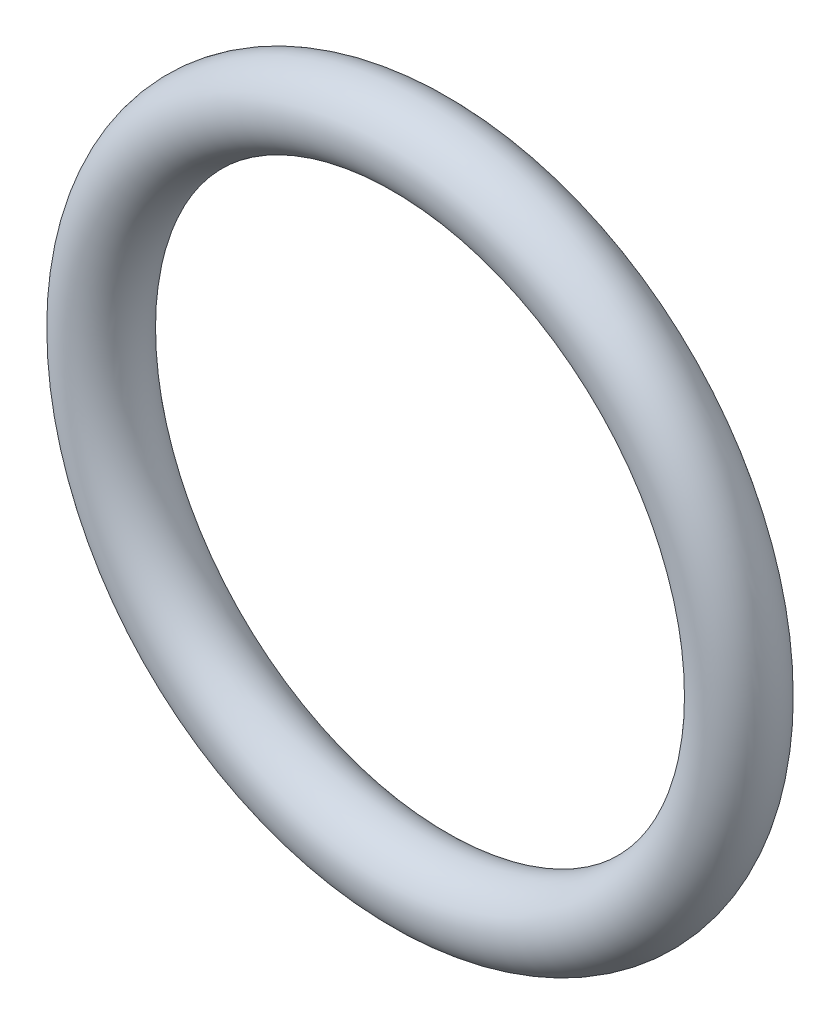
ISO-10303-21;
HEADER;
FILE_DESCRIPTION(('STEP AP214'),'2;1');
FILE_NAME('part.step','',(''),(''),'','','');
FILE_SCHEMA(('AUTOMOTIVE_DESIGN { 1 0 10303 214 1 1 1 1 }'));
ENDSEC;
DATA;
#1=APPLICATION_CONTEXT('core data for automotive mechanical design processes');
#2=APPLICATION_PROTOCOL_DEFINITION('international standard','automotive_design',2000,#1);
#3=PRODUCT_CONTEXT('',#1,'mechanical');
#4=PRODUCT('Part','Part','',(#3));
#5=PRODUCT_RELATED_PRODUCT_CATEGORY('part','',(#4));
#6=PRODUCT_DEFINITION_FORMATION('','',#4);
#7=PRODUCT_DEFINITION_CONTEXT('part definition',#1,'design');
#8=PRODUCT_DEFINITION('design','',#6,#7);
#9=PRODUCT_DEFINITION_SHAPE('','',#8);
#10=(LENGTH_UNIT() NAMED_UNIT(*) SI_UNIT(.MILLI.,.METRE.));
#11=(NAMED_UNIT(*) PLANE_ANGLE_UNIT() SI_UNIT($,.RADIAN.));
#12=(NAMED_UNIT(*) SI_UNIT($,.STERADIAN.) SOLID_ANGLE_UNIT());
#13=UNCERTAINTY_MEASURE_WITH_UNIT(LENGTH_MEASURE(1.E-05),#10,'distance_accuracy_value','');
#14=(GEOMETRIC_REPRESENTATION_CONTEXT(3) GLOBAL_UNCERTAINTY_ASSIGNED_CONTEXT((#13)) GLOBAL_UNIT_ASSIGNED_CONTEXT((#10,
#11,#12)) REPRESENTATION_CONTEXT('',''));
#15=CARTESIAN_POINT('',(0.,0.,0.));
#16=DIRECTION('',(0.,0.,1.));
#17=DIRECTION('',(1.,0.,0.));
#18=AXIS2_PLACEMENT_3D('',#15,#16,#17);
#19=CARTESIAN_POINT('',(0.,0.,0.));
#20=DIRECTION('',(0.,0.,-1.));
#21=DIRECTION('',(-1.,0.,0.));
#22=AXIS2_PLACEMENT_3D('',#19,#20,#21);
#23=TOROIDAL_SURFACE('',#22,145.,17.5);
#24=ADVANCED_FACE('F12',(),#23,.T.);
#25=CLOSED_SHELL('',(#24));
#26=MANIFOLD_SOLID_BREP('B1',#25);
#27=ADVANCED_BREP_SHAPE_REPRESENTATION('',(#18,#26),#14);
#28=SHAPE_DEFINITION_REPRESENTATION(#9,#27);
ENDSEC;
END-ISO-10303-21;
